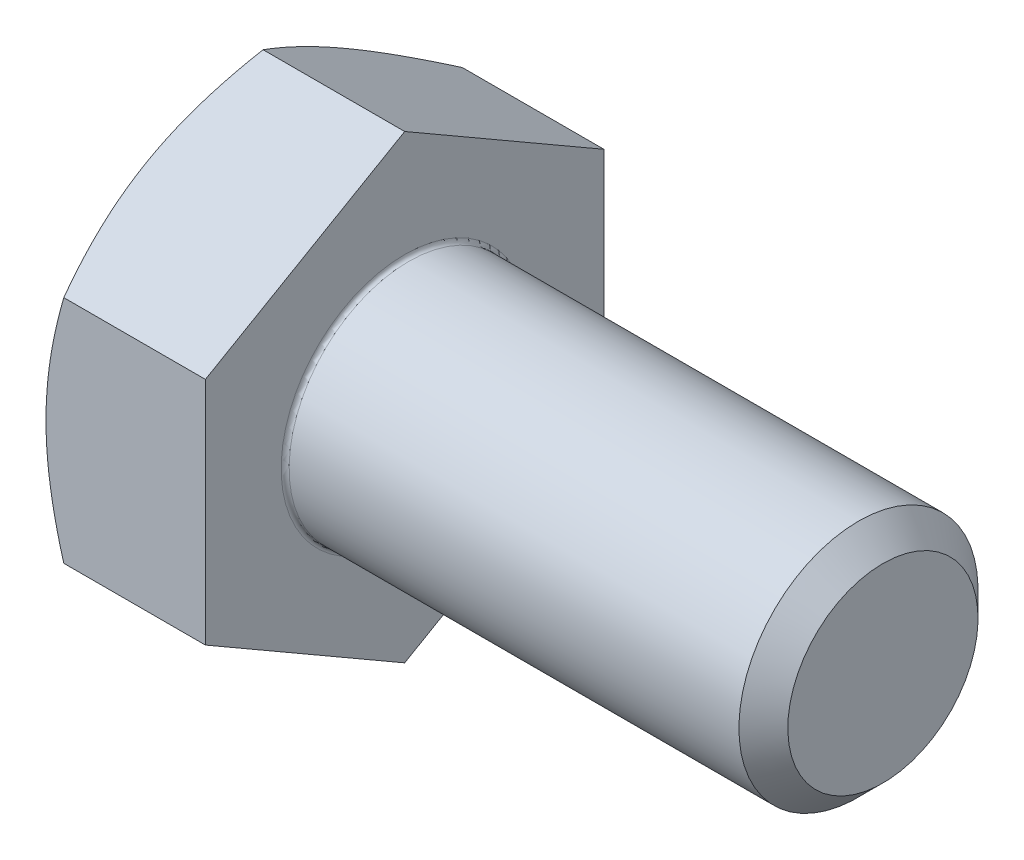
ISO-10303-21;
HEADER;
FILE_DESCRIPTION(('STEP AP214'),'2;1');
FILE_NAME('part.step','',(''),(''),'','','');
FILE_SCHEMA(('AUTOMOTIVE_DESIGN { 1 0 10303 214 1 1 1 1 }'));
ENDSEC;
DATA;
#1=APPLICATION_CONTEXT('core data for automotive mechanical design processes');
#2=APPLICATION_PROTOCOL_DEFINITION('international standard','automotive_design',2000,#1);
#3=PRODUCT_CONTEXT('',#1,'mechanical');
#4=PRODUCT('Part','Part','',(#3));
#5=PRODUCT_RELATED_PRODUCT_CATEGORY('part','',(#4));
#6=PRODUCT_DEFINITION_FORMATION('','',#4);
#7=PRODUCT_DEFINITION_CONTEXT('part definition',#1,'design');
#8=PRODUCT_DEFINITION('design','',#6,#7);
#9=PRODUCT_DEFINITION_SHAPE('','',#8);
#10=(LENGTH_UNIT() NAMED_UNIT(*) SI_UNIT(.MILLI.,.METRE.));
#11=(NAMED_UNIT(*) PLANE_ANGLE_UNIT() SI_UNIT($,.RADIAN.));
#12=(NAMED_UNIT(*) SI_UNIT($,.STERADIAN.) SOLID_ANGLE_UNIT());
#13=UNCERTAINTY_MEASURE_WITH_UNIT(LENGTH_MEASURE(1.E-05),#10,'distance_accuracy_value','');
#14=(GEOMETRIC_REPRESENTATION_CONTEXT(3) GLOBAL_UNCERTAINTY_ASSIGNED_CONTEXT((#13)) GLOBAL_UNIT_ASSIGNED_CONTEXT((#10,
#11,#12)) REPRESENTATION_CONTEXT('',''));
#15=CARTESIAN_POINT('',(0.,0.,0.));
#16=DIRECTION('',(0.,0.,1.));
#17=DIRECTION('',(1.,0.,0.));
#18=AXIS2_PLACEMENT_3D('',#15,#16,#17);
#19=CARTESIAN_POINT('',(-4.,0.,0.));
#20=DIRECTION('',(1.,0.,0.));
#21=DIRECTION('',(0.,-1.,0.));
#22=AXIS2_PLACEMENT_3D('',#19,#20,#21);
#23=PLANE('',#22);
#24=CARTESIAN_POINT('',(-4.,0.,0.));
#25=DIRECTION('',(-1.,0.,0.));
#26=DIRECTION('',(0.,1.,0.));
#27=AXIS2_PLACEMENT_3D('',#24,#25,#26);
#28=CIRCLE('',#27,5.);
#29=CARTESIAN_POINT('',(-4.,4.33012701892219,-2.5));
#30=VERTEX_POINT('',#29);
#31=CARTESIAN_POINT('',(-4.,0.,-5.));
#32=VERTEX_POINT('',#31);
#33=EDGE_CURVE('E215',#30,#32,#28,.T.);
#34=ORIENTED_EDGE('',*,*,#33,.T.);
#35=CARTESIAN_POINT('',(-4.,0.,0.));
#36=DIRECTION('',(-1.,0.,0.));
#37=DIRECTION('',(0.,1.,0.));
#38=AXIS2_PLACEMENT_3D('',#35,#36,#37);
#39=CIRCLE('',#38,5.);
#40=CARTESIAN_POINT('',(-4.,-4.33012701892219,-2.5));
#41=VERTEX_POINT('',#40);
#42=EDGE_CURVE('E65',#32,#41,#39,.T.);
#43=ORIENTED_EDGE('',*,*,#42,.T.);
#44=CARTESIAN_POINT('',(-4.,0.,0.));
#45=DIRECTION('',(-1.,0.,0.));
#46=DIRECTION('',(0.,1.,0.));
#47=AXIS2_PLACEMENT_3D('',#44,#45,#46);
#48=CIRCLE('',#47,5.);
#49=CARTESIAN_POINT('',(-4.,-4.33012701892219,2.5));
#50=VERTEX_POINT('',#49);
#51=EDGE_CURVE('E86',#41,#50,#48,.T.);
#52=ORIENTED_EDGE('',*,*,#51,.T.);
#53=CARTESIAN_POINT('',(-4.,0.,0.));
#54=DIRECTION('',(-1.,0.,0.));
#55=DIRECTION('',(0.,1.,0.));
#56=AXIS2_PLACEMENT_3D('',#53,#54,#55);
#57=CIRCLE('',#56,5.);
#58=CARTESIAN_POINT('',(-4.,0.,5.));
#59=VERTEX_POINT('',#58);
#60=EDGE_CURVE('E207',#50,#59,#57,.T.);
#61=ORIENTED_EDGE('',*,*,#60,.T.);
#62=CARTESIAN_POINT('',(-4.,0.,0.));
#63=DIRECTION('',(-1.,0.,0.));
#64=DIRECTION('',(0.,1.,0.));
#65=AXIS2_PLACEMENT_3D('',#62,#63,#64);
#66=CIRCLE('',#65,5.);
#67=CARTESIAN_POINT('',(-4.,4.33012701892219,2.5));
#68=VERTEX_POINT('',#67);
#69=EDGE_CURVE('E229',#59,#68,#66,.T.);
#70=ORIENTED_EDGE('',*,*,#69,.T.);
#71=CARTESIAN_POINT('',(-4.,0.,0.));
#72=DIRECTION('',(-1.,0.,0.));
#73=DIRECTION('',(0.,1.,0.));
#74=AXIS2_PLACEMENT_3D('',#71,#72,#73);
#75=CIRCLE('',#74,5.);
#76=EDGE_CURVE('E155',#68,#30,#75,.T.);
#77=ORIENTED_EDGE('',*,*,#76,.T.);
#78=EDGE_LOOP('',(#34,#43,#52,#61,#70,#77));
#79=FACE_BOUND('',#78,.T.);
#80=ADVANCED_FACE('F16',(#79),#23,.F.);
#81=CARTESIAN_POINT('',(0.,5.77350269189625,0.));
#82=DIRECTION('',(0.,0.866025403784438,0.5));
#83=DIRECTION('',(1.,0.,0.));
#84=AXIS2_PLACEMENT_3D('',#81,#82,#83);
#85=PLANE('',#84);
#86=CARTESIAN_POINT('',(-4.,4.33012701892219,2.5));
#87=CARTESIAN_POINT('',(-4.,3.66025403784439,3.66025403784437));
#88=CARTESIAN_POINT('',(-3.5534180126148,2.88675134594812,5.));
#89=(BOUNDED_CURVE() B_SPLINE_CURVE(2,(#86,#87,#88),.UNSPECIFIED.,.F.,
.F.) B_SPLINE_CURVE_WITH_KNOTS((3,3),(0.337692975540227,0.636174641111843),
.UNSPECIFIED.) CURVE() GEOMETRIC_REPRESENTATION_ITEM() RATIONAL_B_SPLINE_CURVE((1.,
1.04314139574018,1.0100187493574)) REPRESENTATION_ITEM(''));
#90=CARTESIAN_POINT('',(-3.5534180126148,2.88675134594812,5.));
#91=VERTEX_POINT('',#90);
#92=EDGE_CURVE('E225',#68,#91,#89,.T.);
#93=ORIENTED_EDGE('',*,*,#92,.T.);
#94=DIRECTION('',(-1.,0.,0.));
#95=VECTOR('',#94,1.);
#96=CARTESIAN_POINT('',(0.,2.88675134594812,5.));
#97=LINE('',#96,#95);
#98=CARTESIAN_POINT('',(0.,2.88675134594812,5.));
#99=VERTEX_POINT('',#98);
#100=EDGE_CURVE('E29',#99,#91,#97,.T.);
#101=ORIENTED_EDGE('',*,*,#100,.F.);
#102=DIRECTION('',(0.,-0.5,0.866025403784438));
#103=VECTOR('',#102,1.);
#104=CARTESIAN_POINT('',(0.,5.77350269189625,0.));
#105=LINE('',#104,#103);
#106=CARTESIAN_POINT('',(0.,5.77350269189625,0.));
#107=VERTEX_POINT('',#106);
#108=EDGE_CURVE('E145',#107,#99,#105,.T.);
#109=ORIENTED_EDGE('',*,*,#108,.F.);
#110=DIRECTION('',(-1.,0.,0.));
#111=VECTOR('',#110,1.);
#112=CARTESIAN_POINT('',(0.,5.77350269189625,0.));
#113=LINE('',#112,#111);
#114=CARTESIAN_POINT('',(-3.5534180126148,5.77350269189625,0.));
#115=VERTEX_POINT('',#114);
#116=EDGE_CURVE('E11',#107,#115,#113,.T.);
#117=ORIENTED_EDGE('',*,*,#116,.T.);
#118=CARTESIAN_POINT('',(-3.5534180126148,5.77350269189625,0.));
#119=CARTESIAN_POINT('',(-4.,4.99999999999999,1.33974596215563));
#120=CARTESIAN_POINT('',(-4.,4.33012701892219,2.5));
#121=(BOUNDED_CURVE() B_SPLINE_CURVE(2,(#118,#119,#120),.UNSPECIFIED.,.F.,
.F.) B_SPLINE_CURVE_WITH_KNOTS((3,3),(0.0392113099686116,0.337692975540227),
.UNSPECIFIED.) CURVE() GEOMETRIC_REPRESENTATION_ITEM() RATIONAL_B_SPLINE_CURVE((1.0100187493574,
1.04314139574016,1.)) REPRESENTATION_ITEM(''));
#122=EDGE_CURVE('E143',#115,#68,#121,.T.);
#123=ORIENTED_EDGE('',*,*,#122,.T.);
#124=EDGE_LOOP('',(#93,#101,#109,#117,#123));
#125=FACE_BOUND('',#124,.T.);
#126=ADVANCED_FACE('F18',(#125),#85,.T.);
#127=CARTESIAN_POINT('',(0.,2.88675134594813,-5.));
#128=DIRECTION('',(0.,0.866025403784439,-0.5));
#129=DIRECTION('',(-1.,0.,0.));
#130=AXIS2_PLACEMENT_3D('',#127,#128,#129);
#131=PLANE('',#130);
#132=CARTESIAN_POINT('',(-4.,4.33012701892219,-2.5));
#133=CARTESIAN_POINT('',(-4.,4.99999999999999,-1.33974596215562));
#134=CARTESIAN_POINT('',(-3.5534180126148,5.77350269189625,0.));
#135=(BOUNDED_CURVE() B_SPLINE_CURVE(2,(#132,#133,#134),.UNSPECIFIED.,.F.,
.F.) B_SPLINE_CURVE_WITH_KNOTS((3,3),(0.337692975540226,0.636174641111842),
.UNSPECIFIED.) CURVE() GEOMETRIC_REPRESENTATION_ITEM() RATIONAL_B_SPLINE_CURVE((1.,
1.04314139574017,1.0100187493574)) REPRESENTATION_ITEM(''));
#136=EDGE_CURVE('E148',#30,#115,#135,.T.);
#137=ORIENTED_EDGE('',*,*,#136,.T.);
#138=ORIENTED_EDGE('',*,*,#116,.F.);
#139=DIRECTION('',(0.,0.5,0.866025403784439));
#140=VECTOR('',#139,1.);
#141=CARTESIAN_POINT('',(0.,2.88675134594813,-5.));
#142=LINE('',#141,#140);
#143=CARTESIAN_POINT('',(0.,2.88675134594813,-5.));
#144=VERTEX_POINT('',#143);
#145=EDGE_CURVE('E166',#144,#107,#142,.T.);
#146=ORIENTED_EDGE('',*,*,#145,.F.);
#147=DIRECTION('',(-1.,0.,0.));
#148=VECTOR('',#147,1.);
#149=CARTESIAN_POINT('',(0.,2.88675134594813,-5.));
#150=LINE('',#149,#148);
#151=CARTESIAN_POINT('',(-3.5534180126148,2.88675134594813,-5.));
#152=VERTEX_POINT('',#151);
#153=EDGE_CURVE('E43',#144,#152,#150,.T.);
#154=ORIENTED_EDGE('',*,*,#153,.T.);
#155=CARTESIAN_POINT('',(-3.5534180126148,2.88675134594813,-5.));
#156=CARTESIAN_POINT('',(-4.,3.66025403784439,-3.66025403784437));
#157=CARTESIAN_POINT('',(-4.,4.33012701892219,-2.5));
#158=(BOUNDED_CURVE() B_SPLINE_CURVE(2,(#155,#156,#157),.UNSPECIFIED.,.F.,
.F.) B_SPLINE_CURVE_WITH_KNOTS((3,3),(0.0392113099686102,0.337692975540226),
.UNSPECIFIED.) CURVE() GEOMETRIC_REPRESENTATION_ITEM() RATIONAL_B_SPLINE_CURVE((1.0100187493574,
1.04314139574018,1.)) REPRESENTATION_ITEM(''));
#159=EDGE_CURVE('E150',#152,#30,#158,.T.);
#160=ORIENTED_EDGE('',*,*,#159,.T.);
#161=EDGE_LOOP('',(#137,#138,#146,#154,#160));
#162=FACE_BOUND('',#161,.T.);
#163=ADVANCED_FACE('F149',(#162),#131,.T.);
#164=CARTESIAN_POINT('',(0.,2.88675134594812,5.));
#165=DIRECTION('',(0.,0.,1.));
#166=DIRECTION('',(0.,-1.,0.));
#167=AXIS2_PLACEMENT_3D('',#164,#165,#166);
#168=PLANE('',#167);
#169=CARTESIAN_POINT('',(-4.,0.,5.));
#170=CARTESIAN_POINT('',(-4.,-1.3397459621556,5.));
#171=CARTESIAN_POINT('',(-3.5534180126148,-2.88675134594813,4.99999999999999));
#172=(BOUNDED_CURVE() B_SPLINE_CURVE(2,(#169,#170,#171),.UNSPECIFIED.,.F.,
.F.) B_SPLINE_CURVE_WITH_KNOTS((3,3),(0.337692975540227,0.636174641111843),
.UNSPECIFIED.) CURVE() GEOMETRIC_REPRESENTATION_ITEM() RATIONAL_B_SPLINE_CURVE((1.,
1.04314139574018,1.0100187493574)) REPRESENTATION_ITEM(''));
#173=CARTESIAN_POINT('',(-3.5534180126148,-2.88675134594813,5.));
#174=VERTEX_POINT('',#173);
#175=EDGE_CURVE('E198',#59,#174,#172,.T.);
#176=ORIENTED_EDGE('',*,*,#175,.T.);
#177=DIRECTION('',(-1.,0.,0.));
#178=VECTOR('',#177,1.);
#179=CARTESIAN_POINT('',(0.,-2.88675134594813,5.));
#180=LINE('',#179,#178);
#181=CARTESIAN_POINT('',(0.,-2.88675134594813,5.));
#182=VERTEX_POINT('',#181);
#183=EDGE_CURVE('E270',#182,#174,#180,.T.);
#184=ORIENTED_EDGE('',*,*,#183,.F.);
#185=DIRECTION('',(0.,-1.,0.));
#186=VECTOR('',#185,1.);
#187=CARTESIAN_POINT('',(0.,2.88675134594812,5.));
#188=LINE('',#187,#186);
#189=EDGE_CURVE('E255',#99,#182,#188,.T.);
#190=ORIENTED_EDGE('',*,*,#189,.F.);
#191=ORIENTED_EDGE('',*,*,#100,.T.);
#192=CARTESIAN_POINT('',(-3.5534180126148,2.88675134594812,5.));
#193=CARTESIAN_POINT('',(-4.,1.3397459621556,5.));
#194=CARTESIAN_POINT('',(-4.,0.,5.));
#195=(BOUNDED_CURVE() B_SPLINE_CURVE(2,(#192,#193,#194),.UNSPECIFIED.,.F.,
.F.) B_SPLINE_CURVE_WITH_KNOTS((3,3),(0.0392113099686117,0.337692975540227),
.UNSPECIFIED.) CURVE() GEOMETRIC_REPRESENTATION_ITEM() RATIONAL_B_SPLINE_CURVE((1.0100187493574,
1.04314139574017,1.)) REPRESENTATION_ITEM(''));
#196=EDGE_CURVE('E214',#91,#59,#195,.T.);
#197=ORIENTED_EDGE('',*,*,#196,.T.);
#198=EDGE_LOOP('',(#176,#184,#190,#191,#197));
#199=FACE_BOUND('',#198,.T.);
#200=ADVANCED_FACE('F586',(#199),#168,.T.);
#201=CARTESIAN_POINT('',(0.,-2.88675134594812,-5.));
#202=DIRECTION('',(0.,0.,-1.));
#203=DIRECTION('',(-1.,0.,0.));
#204=AXIS2_PLACEMENT_3D('',#201,#202,#203);
#205=PLANE('',#204);
#206=CARTESIAN_POINT('',(-3.5534180126148,-2.88675134594812,-5.));
#207=CARTESIAN_POINT('',(-4.,-1.3397459621556,-5.));
#208=CARTESIAN_POINT('',(-4.,0.,-5.));
#209=(BOUNDED_CURVE() B_SPLINE_CURVE(2,(#206,#207,#208),.UNSPECIFIED.,.F.,
.F.) B_SPLINE_CURVE_WITH_KNOTS((3,3),(0.0392113099686106,0.337692975540227),
.UNSPECIFIED.) CURVE() GEOMETRIC_REPRESENTATION_ITEM() RATIONAL_B_SPLINE_CURVE((1.0100187493574,
1.04314139574019,1.)) REPRESENTATION_ITEM(''));
#210=CARTESIAN_POINT('',(-3.5534180126148,-2.88675134594812,-5.));
#211=VERTEX_POINT('',#210);
#212=EDGE_CURVE('E172',#211,#32,#209,.T.);
#213=ORIENTED_EDGE('',*,*,#212,.T.);
#214=CARTESIAN_POINT('',(-4.,0.,-5.));
#215=CARTESIAN_POINT('',(-4.,1.3397459621556,-5.));
#216=CARTESIAN_POINT('',(-3.5534180126148,2.88675134594813,-5.));
#217=(BOUNDED_CURVE() B_SPLINE_CURVE(2,(#214,#215,#216),.UNSPECIFIED.,.F.,
.F.) B_SPLINE_CURVE_WITH_KNOTS((3,3),(0.337692975540227,0.636174641111842),
.UNSPECIFIED.) CURVE() GEOMETRIC_REPRESENTATION_ITEM() RATIONAL_B_SPLINE_CURVE((1.,
1.04314139574017,1.0100187493574)) REPRESENTATION_ITEM(''));
#218=EDGE_CURVE('E20',#32,#152,#217,.T.);
#219=ORIENTED_EDGE('',*,*,#218,.T.);
#220=ORIENTED_EDGE('',*,*,#153,.F.);
#221=DIRECTION('',(0.,1.,0.));
#222=VECTOR('',#221,1.);
#223=CARTESIAN_POINT('',(0.,-2.88675134594812,-5.));
#224=LINE('',#223,#222);
#225=CARTESIAN_POINT('',(0.,-2.88675134594812,-5.));
#226=VERTEX_POINT('',#225);
#227=EDGE_CURVE('E190',#226,#144,#224,.T.);
#228=ORIENTED_EDGE('',*,*,#227,.F.);
#229=DIRECTION('',(-1.,0.,0.));
#230=VECTOR('',#229,1.);
#231=CARTESIAN_POINT('',(0.,-2.88675134594812,-5.));
#232=LINE('',#231,#230);
#233=EDGE_CURVE('E124',#226,#211,#232,.T.);
#234=ORIENTED_EDGE('',*,*,#233,.T.);
#235=EDGE_LOOP('',(#213,#219,#220,#228,#234));
#236=FACE_BOUND('',#235,.T.);
#237=ADVANCED_FACE('F351',(#236),#205,.T.);
#238=CARTESIAN_POINT('',(0.,-5.77350269189625,0.));
#239=DIRECTION('',(0.,-0.866025403784439,-0.5));
#240=DIRECTION('',(0.,0.5,-0.866025403784439));
#241=AXIS2_PLACEMENT_3D('',#238,#239,#240);
#242=PLANE('',#241);
#243=CARTESIAN_POINT('',(-3.5534180126148,-5.77350269189625,0.));
#244=CARTESIAN_POINT('',(-4.,-4.99999999999999,-1.33974596215563));
#245=CARTESIAN_POINT('',(-4.,-4.33012701892219,-2.5));
#246=(BOUNDED_CURVE() B_SPLINE_CURVE(2,(#243,#244,#245),.UNSPECIFIED.,.F.,
.F.) B_SPLINE_CURVE_WITH_KNOTS((3,3),(0.0392113099686109,0.337692975540227),
.UNSPECIFIED.) CURVE() GEOMETRIC_REPRESENTATION_ITEM() RATIONAL_B_SPLINE_CURVE((1.01001874935741,
1.04314139574019,1.)) REPRESENTATION_ITEM(''));
#247=CARTESIAN_POINT('',(-3.5534180126148,-5.77350269189625,0.));
#248=VERTEX_POINT('',#247);
#249=EDGE_CURVE('E193',#248,#41,#246,.T.);
#250=ORIENTED_EDGE('',*,*,#249,.T.);
#251=CARTESIAN_POINT('',(-4.,-4.33012701892219,-2.5));
#252=CARTESIAN_POINT('',(-4.,-3.66025403784439,-3.66025403784438));
#253=CARTESIAN_POINT('',(-3.5534180126148,-2.88675134594812,-5.));
#254=(BOUNDED_CURVE() B_SPLINE_CURVE(2,(#251,#252,#253),.UNSPECIFIED.,.F.,
.F.) B_SPLINE_CURVE_WITH_KNOTS((3,3),(0.337692975540227,0.636174641111843),
.UNSPECIFIED.) CURVE() GEOMETRIC_REPRESENTATION_ITEM() RATIONAL_B_SPLINE_CURVE((1.,
1.04314139574018,1.0100187493574)) REPRESENTATION_ITEM(''));
#255=EDGE_CURVE('E186',#41,#211,#254,.T.);
#256=ORIENTED_EDGE('',*,*,#255,.T.);
#257=ORIENTED_EDGE('',*,*,#233,.F.);
#258=DIRECTION('',(0.,0.5,-0.866025403784439));
#259=VECTOR('',#258,1.);
#260=CARTESIAN_POINT('',(0.,-5.77350269189625,0.));
#261=LINE('',#260,#259);
#262=CARTESIAN_POINT('',(0.,-5.77350269189625,0.));
#263=VERTEX_POINT('',#262);
#264=EDGE_CURVE('E247',#263,#226,#261,.T.);
#265=ORIENTED_EDGE('',*,*,#264,.F.);
#266=DIRECTION('',(-1.,0.,0.));
#267=VECTOR('',#266,1.);
#268=CARTESIAN_POINT('',(0.,-5.77350269189625,0.));
#269=LINE('',#268,#267);
#270=EDGE_CURVE('E78',#263,#248,#269,.T.);
#271=ORIENTED_EDGE('',*,*,#270,.T.);
#272=EDGE_LOOP('',(#250,#256,#257,#265,#271));
#273=FACE_BOUND('',#272,.T.);
#274=ADVANCED_FACE('F569',(#273),#242,.T.);
#275=CARTESIAN_POINT('',(0.,-2.88675134594813,5.));
#276=DIRECTION('',(0.,-0.866025403784439,0.5));
#277=DIRECTION('',(-1.,0.,0.));
#278=AXIS2_PLACEMENT_3D('',#275,#276,#277);
#279=PLANE('',#278);
#280=CARTESIAN_POINT('',(-3.5534180126148,-2.88675134594813,4.99999999999999));
#281=CARTESIAN_POINT('',(-4.,-3.66025403784439,3.66025403784437));
#282=CARTESIAN_POINT('',(-4.,-4.33012701892219,2.5));
#283=(BOUNDED_CURVE() B_SPLINE_CURVE(2,(#280,#281,#282),.UNSPECIFIED.,.F.,
.F.) B_SPLINE_CURVE_WITH_KNOTS((3,3),(0.0392113099686112,0.337692975540227),
.UNSPECIFIED.) CURVE() GEOMETRIC_REPRESENTATION_ITEM() RATIONAL_B_SPLINE_CURVE((1.0100187493574,
1.04314139574018,1.)) REPRESENTATION_ITEM(''));
#284=EDGE_CURVE('E208',#174,#50,#283,.T.);
#285=ORIENTED_EDGE('',*,*,#284,.T.);
#286=CARTESIAN_POINT('',(-4.,-4.33012701892219,2.5));
#287=CARTESIAN_POINT('',(-4.,-4.99999999999999,1.33974596215561));
#288=CARTESIAN_POINT('',(-3.5534180126148,-5.77350269189625,0.));
#289=(BOUNDED_CURVE() B_SPLINE_CURVE(2,(#286,#287,#288),.UNSPECIFIED.,.F.,
.F.) B_SPLINE_CURVE_WITH_KNOTS((3,3),(0.337692975540227,0.636174641111844),
.UNSPECIFIED.) CURVE() GEOMETRIC_REPRESENTATION_ITEM() RATIONAL_B_SPLINE_CURVE((1.,
1.04314139574021,1.01001874935741)) REPRESENTATION_ITEM(''));
#290=EDGE_CURVE('E223',#50,#248,#289,.T.);
#291=ORIENTED_EDGE('',*,*,#290,.T.);
#292=ORIENTED_EDGE('',*,*,#270,.F.);
#293=DIRECTION('',(0.,-0.5,-0.866025403784439));
#294=VECTOR('',#293,1.);
#295=CARTESIAN_POINT('',(0.,-2.88675134594813,5.));
#296=LINE('',#295,#294);
#297=EDGE_CURVE('E254',#182,#263,#296,.T.);
#298=ORIENTED_EDGE('',*,*,#297,.F.);
#299=ORIENTED_EDGE('',*,*,#183,.T.);
#300=EDGE_LOOP('',(#285,#291,#292,#298,#299));
#301=FACE_BOUND('',#300,.T.);
#302=ADVANCED_FACE('F315',(#301),#279,.T.);
#303=CARTESIAN_POINT('',(-3.71132486540519,0.,0.));
#304=DIRECTION('',(1.,0.,0.));
#305=DIRECTION('',(0.,1.,0.));
#306=AXIS2_PLACEMENT_3D('',#303,#304,#305);
#307=CONICAL_SURFACE('',#306,5.5,1.0471975512);
#308=ORIENTED_EDGE('',*,*,#218,.F.);
#309=ORIENTED_EDGE('',*,*,#33,.F.);
#310=ORIENTED_EDGE('',*,*,#159,.F.);
#311=EDGE_LOOP('',(#308,#309,#310));
#312=FACE_BOUND('',#311,.T.);
#313=ADVANCED_FACE('F550',(#312),#307,.T.);
#314=CARTESIAN_POINT('',(-3.71132486540519,0.,0.));
#315=DIRECTION('',(1.,0.,0.));
#316=DIRECTION('',(0.,1.,0.));
#317=AXIS2_PLACEMENT_3D('',#314,#315,#316);
#318=CONICAL_SURFACE('',#317,5.5,1.0471975512);
#319=ORIENTED_EDGE('',*,*,#255,.F.);
#320=ORIENTED_EDGE('',*,*,#42,.F.);
#321=ORIENTED_EDGE('',*,*,#212,.F.);
#322=EDGE_LOOP('',(#319,#320,#321));
#323=FACE_BOUND('',#322,.T.);
#324=ADVANCED_FACE('F539',(#323),#318,.T.);
#325=CARTESIAN_POINT('',(-3.71132486540519,0.,0.));
#326=DIRECTION('',(1.,0.,0.));
#327=DIRECTION('',(0.,1.,0.));
#328=AXIS2_PLACEMENT_3D('',#325,#326,#327);
#329=CONICAL_SURFACE('',#328,5.5,1.0471975512);
#330=ORIENTED_EDGE('',*,*,#290,.F.);
#331=ORIENTED_EDGE('',*,*,#51,.F.);
#332=ORIENTED_EDGE('',*,*,#249,.F.);
#333=EDGE_LOOP('',(#330,#331,#332));
#334=FACE_BOUND('',#333,.T.);
#335=ADVANCED_FACE('F530',(#334),#329,.T.);
#336=CARTESIAN_POINT('',(-3.71132486540519,0.,0.));
#337=DIRECTION('',(1.,0.,0.));
#338=DIRECTION('',(0.,1.,0.));
#339=AXIS2_PLACEMENT_3D('',#336,#337,#338);
#340=CONICAL_SURFACE('',#339,5.5,1.0471975512);
#341=ORIENTED_EDGE('',*,*,#284,.F.);
#342=ORIENTED_EDGE('',*,*,#175,.F.);
#343=ORIENTED_EDGE('',*,*,#60,.F.);
#344=EDGE_LOOP('',(#341,#342,#343));
#345=FACE_BOUND('',#344,.T.);
#346=ADVANCED_FACE('F319',(#345),#340,.T.);
#347=CARTESIAN_POINT('',(-3.71132486540519,0.,0.));
#348=DIRECTION('',(1.,0.,0.));
#349=DIRECTION('',(0.,1.,0.));
#350=AXIS2_PLACEMENT_3D('',#347,#348,#349);
#351=CONICAL_SURFACE('',#350,5.5,1.0471975512);
#352=ORIENTED_EDGE('',*,*,#196,.F.);
#353=ORIENTED_EDGE('',*,*,#92,.F.);
#354=ORIENTED_EDGE('',*,*,#69,.F.);
#355=EDGE_LOOP('',(#352,#353,#354));
#356=FACE_BOUND('',#355,.T.);
#357=ADVANCED_FACE('F322',(#356),#351,.T.);
#358=CARTESIAN_POINT('',(-3.71132486540519,0.,0.));
#359=DIRECTION('',(1.,0.,0.));
#360=DIRECTION('',(0.,1.,0.));
#361=AXIS2_PLACEMENT_3D('',#358,#359,#360);
#362=CONICAL_SURFACE('',#361,5.5,1.0471975512);
#363=ORIENTED_EDGE('',*,*,#122,.F.);
#364=ORIENTED_EDGE('',*,*,#136,.F.);
#365=ORIENTED_EDGE('',*,*,#76,.F.);
#366=EDGE_LOOP('',(#363,#364,#365));
#367=FACE_BOUND('',#366,.T.);
#368=ADVANCED_FACE('F157',(#367),#362,.T.);
#369=CARTESIAN_POINT('',(12.,1.5,0.));
#370=DIRECTION('',(1.,0.,0.));
#371=DIRECTION('',(0.,-1.,0.));
#372=AXIS2_PLACEMENT_3D('',#369,#370,#371);
#373=PLANE('',#372);
#374=CARTESIAN_POINT('',(12.,0.,0.));
#375=DIRECTION('',(-1.,0.,0.));
#376=DIRECTION('',(0.,-1.,0.));
#377=AXIS2_PLACEMENT_3D('',#374,#375,#376);
#378=CIRCLE('',#377,2.38655);
#379=CARTESIAN_POINT('',(12.,2.38655,0.));
#380=VERTEX_POINT('',#379);
#381=EDGE_CURVE('E160',#380,#380,#378,.T.);
#382=ORIENTED_EDGE('',*,*,#381,.F.);
#383=EDGE_LOOP('',(#382));
#384=FACE_BOUND('',#383,.T.);
#385=ADVANCED_FACE('F489',(#384),#373,.T.);
#386=CARTESIAN_POINT('',(11.693225,0.,0.));
#387=DIRECTION('',(-1.,0.,0.));
#388=DIRECTION('',(0.,-1.,0.));
#389=AXIS2_PLACEMENT_3D('',#386,#387,#388);
#390=CONICAL_SURFACE('',#389,2.693275,0.785316663807675);
#391=ORIENTED_EDGE('',*,*,#381,.T.);
#392=EDGE_LOOP('',(#391));
#393=FACE_BOUND('',#392,.T.);
#394=CARTESIAN_POINT('',(11.38645,0.,0.));
#395=DIRECTION('',(1.,0.,0.));
#396=DIRECTION('',(0.,-1.,0.));
#397=AXIS2_PLACEMENT_3D('',#394,#395,#396);
#398=CIRCLE('',#397,3.);
#399=CARTESIAN_POINT('',(11.38645,3.,0.));
#400=VERTEX_POINT('',#399);
#401=EDGE_CURVE('E183',#400,#400,#398,.T.);
#402=ORIENTED_EDGE('',*,*,#401,.T.);
#403=EDGE_LOOP('',(#402));
#404=FACE_BOUND('',#403,.T.);
#405=ADVANCED_FACE('F347',(#393,#404),#390,.T.);
#406=CARTESIAN_POINT('',(0.,0.,0.));
#407=DIRECTION('',(1.,0.,0.));
#408=DIRECTION('',(0.,-1.,0.));
#409=AXIS2_PLACEMENT_3D('',#406,#407,#408);
#410=PLANE('',#409);
#411=CARTESIAN_POINT('',(0.,0.,0.));
#412=DIRECTION('',(1.,0.,0.));
#413=DIRECTION('',(0.,-1.,0.));
#414=AXIS2_PLACEMENT_3D('',#411,#412,#413);
#415=CIRCLE('',#414,3.1);
#416=CARTESIAN_POINT('',(0.,3.1,0.));
#417=VERTEX_POINT('',#416);
#418=EDGE_CURVE('E184',#417,#417,#415,.T.);
#419=ORIENTED_EDGE('',*,*,#418,.F.);
#420=EDGE_LOOP('',(#419));
#421=FACE_BOUND('',#420,.T.);
#422=ORIENTED_EDGE('',*,*,#108,.T.);
#423=ORIENTED_EDGE('',*,*,#189,.T.);
#424=ORIENTED_EDGE('',*,*,#297,.T.);
#425=ORIENTED_EDGE('',*,*,#264,.T.);
#426=ORIENTED_EDGE('',*,*,#227,.T.);
#427=ORIENTED_EDGE('',*,*,#145,.T.);
#428=EDGE_LOOP('',(#422,#423,#424,#425,#426,#427));
#429=FACE_BOUND('',#428,.T.);
#430=ADVANCED_FACE('F343',(#421,#429),#410,.T.);
#431=CARTESIAN_POINT('',(6.,0.,0.));
#432=DIRECTION('',(1.,0.,0.));
#433=DIRECTION('',(0.,1.,0.));
#434=AXIS2_PLACEMENT_3D('',#431,#432,#433);
#435=CYLINDRICAL_SURFACE('',#434,3.);
#436=CARTESIAN_POINT('',(0.1,0.,0.));
#437=DIRECTION('',(-1.,0.,0.));
#438=DIRECTION('',(0.,-1.,0.));
#439=AXIS2_PLACEMENT_3D('',#436,#437,#438);
#440=CIRCLE('',#439,3.);
#441=CARTESIAN_POINT('',(0.1,3.,0.));
#442=VERTEX_POINT('',#441);
#443=EDGE_CURVE('E176',#442,#442,#440,.T.);
#444=ORIENTED_EDGE('',*,*,#443,.F.);
#445=EDGE_LOOP('',(#444));
#446=FACE_BOUND('',#445,.T.);
#447=ORIENTED_EDGE('',*,*,#401,.F.);
#448=EDGE_LOOP('',(#447));
#449=FACE_BOUND('',#448,.T.);
#450=ADVANCED_FACE('F346',(#446,#449),#435,.T.);
#451=CARTESIAN_POINT('',(0.1,0.,0.));
#452=DIRECTION('',(1.,0.,0.));
#453=DIRECTION('',(0.,0.,-1.));
#454=AXIS2_PLACEMENT_3D('',#451,#452,#453);
#455=TOROIDAL_SURFACE('',#454,3.1,0.1);
#456=ORIENTED_EDGE('',*,*,#443,.T.);
#457=EDGE_LOOP('',(#456));
#458=FACE_BOUND('',#457,.T.);
#459=ORIENTED_EDGE('',*,*,#418,.T.);
#460=EDGE_LOOP('',(#459));
#461=FACE_BOUND('',#460,.T.);
#462=ADVANCED_FACE('F341',(#458,#461),#455,.F.);
#463=CLOSED_SHELL('',(#80,#126,#163,#200,#237,#274,#302,#313,#324,#335,#346,#357,#368,#385,#405,
#430,#450,#462));
#464=MANIFOLD_SOLID_BREP('B1',#463);
#465=ADVANCED_BREP_SHAPE_REPRESENTATION('',(#18,#464),#14);
#466=SHAPE_DEFINITION_REPRESENTATION(#9,#465);
ENDSEC;
END-ISO-10303-21;
